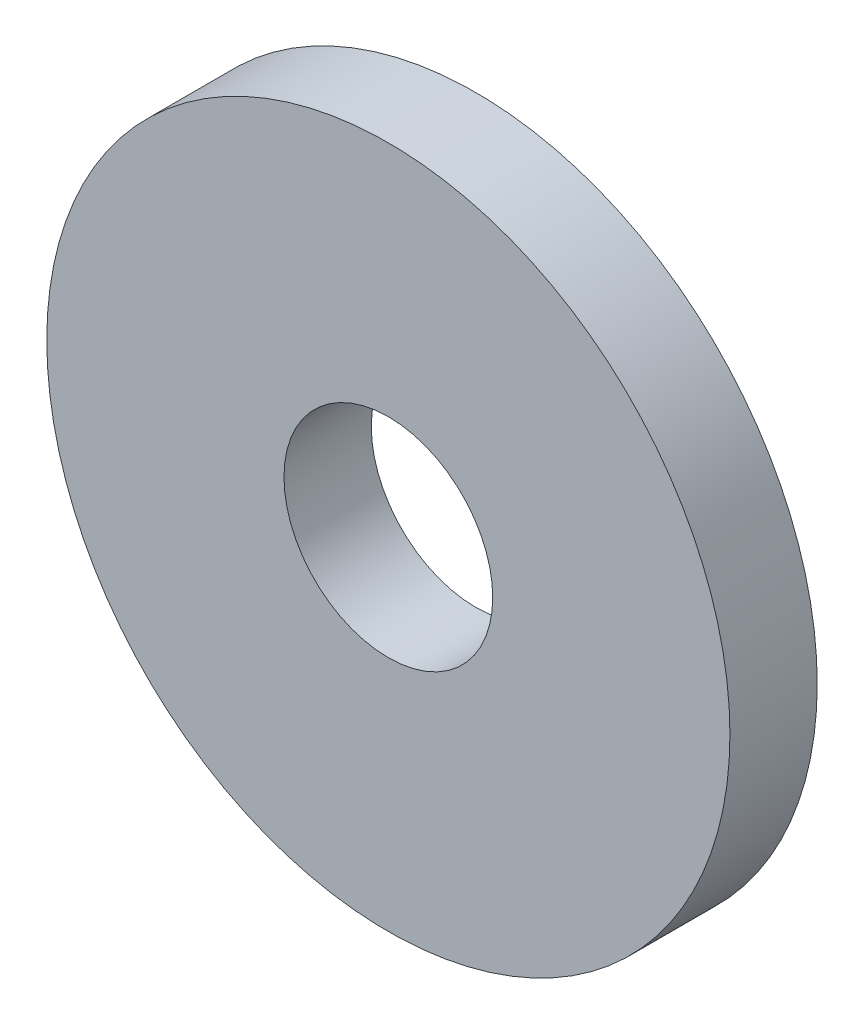
ISO-10303-21;
HEADER;
FILE_DESCRIPTION(('STEP AP214'),'2;1');
FILE_NAME('part.step','',(''),(''),'','','');
FILE_SCHEMA(('AUTOMOTIVE_DESIGN { 1 0 10303 214 1 1 1 1 }'));
ENDSEC;
DATA;
#1=APPLICATION_CONTEXT('core data for automotive mechanical design processes');
#2=APPLICATION_PROTOCOL_DEFINITION('international standard','automotive_design',2000,#1);
#3=PRODUCT_CONTEXT('',#1,'mechanical');
#4=PRODUCT('Part','Part','',(#3));
#5=PRODUCT_RELATED_PRODUCT_CATEGORY('part','',(#4));
#6=PRODUCT_DEFINITION_FORMATION('','',#4);
#7=PRODUCT_DEFINITION_CONTEXT('part definition',#1,'design');
#8=PRODUCT_DEFINITION('design','',#6,#7);
#9=PRODUCT_DEFINITION_SHAPE('','',#8);
#10=(LENGTH_UNIT() NAMED_UNIT(*) SI_UNIT(.MILLI.,.METRE.));
#11=(NAMED_UNIT(*) PLANE_ANGLE_UNIT() SI_UNIT($,.RADIAN.));
#12=(NAMED_UNIT(*) SI_UNIT($,.STERADIAN.) SOLID_ANGLE_UNIT());
#13=UNCERTAINTY_MEASURE_WITH_UNIT(LENGTH_MEASURE(1.E-05),#10,'distance_accuracy_value','');
#14=(GEOMETRIC_REPRESENTATION_CONTEXT(3) GLOBAL_UNCERTAINTY_ASSIGNED_CONTEXT((#13)) GLOBAL_UNIT_ASSIGNED_CONTEXT((#10,
#11,#12)) REPRESENTATION_CONTEXT('',''));
#15=CARTESIAN_POINT('',(0.,0.,0.));
#16=DIRECTION('',(0.,0.,1.));
#17=DIRECTION('',(1.,0.,0.));
#18=AXIS2_PLACEMENT_3D('',#15,#16,#17);
#19=CARTESIAN_POINT('',(0.,0.,2.3));
#20=DIRECTION('',(0.,0.,1.));
#21=DIRECTION('',(1.,0.,0.));
#22=AXIS2_PLACEMENT_3D('',#19,#20,#21);
#23=PLANE('',#22);
#24=CARTESIAN_POINT('',(0.,0.,2.3));
#25=DIRECTION('',(0.,0.,1.));
#26=DIRECTION('',(1.,0.,0.));
#27=AXIS2_PLACEMENT_3D('',#24,#25,#26);
#28=CIRCLE('',#27,9.);
#29=CARTESIAN_POINT('',(9.,0.,2.3));
#30=VERTEX_POINT('',#29);
#31=EDGE_CURVE('E10',#30,#30,#28,.T.);
#32=ORIENTED_EDGE('',*,*,#31,.T.);
#33=EDGE_LOOP('',(#32));
#34=FACE_BOUND('',#33,.T.);
#35=CARTESIAN_POINT('',(0.,0.,2.3));
#36=DIRECTION('',(0.,0.,1.));
#37=DIRECTION('',(1.,0.,0.));
#38=AXIS2_PLACEMENT_3D('',#35,#36,#37);
#39=CIRCLE('',#38,2.75);
#40=CARTESIAN_POINT('',(2.75,0.,2.3));
#41=VERTEX_POINT('',#40);
#42=EDGE_CURVE('E41',#41,#41,#39,.T.);
#43=ORIENTED_EDGE('',*,*,#42,.F.);
#44=EDGE_LOOP('',(#43));
#45=FACE_BOUND('',#44,.T.);
#46=ADVANCED_FACE('F30',(#34,#45),#23,.T.);
#47=CARTESIAN_POINT('',(0.,0.,0.));
#48=DIRECTION('',(0.,0.,1.));
#49=DIRECTION('',(1.,0.,0.));
#50=AXIS2_PLACEMENT_3D('',#47,#48,#49);
#51=PLANE('',#50);
#52=CARTESIAN_POINT('',(0.,0.,0.));
#53=DIRECTION('',(0.,0.,1.));
#54=DIRECTION('',(1.,0.,0.));
#55=AXIS2_PLACEMENT_3D('',#52,#53,#54);
#56=CIRCLE('',#55,9.);
#57=CARTESIAN_POINT('',(9.,0.,0.));
#58=VERTEX_POINT('',#57);
#59=EDGE_CURVE('E34',#58,#58,#56,.T.);
#60=ORIENTED_EDGE('',*,*,#59,.F.);
#61=EDGE_LOOP('',(#60));
#62=FACE_BOUND('',#61,.T.);
#63=CARTESIAN_POINT('',(0.,0.,0.));
#64=DIRECTION('',(0.,0.,1.));
#65=DIRECTION('',(1.,0.,0.));
#66=AXIS2_PLACEMENT_3D('',#63,#64,#65);
#67=CIRCLE('',#66,2.75);
#68=CARTESIAN_POINT('',(2.75,0.,0.));
#69=VERTEX_POINT('',#68);
#70=EDGE_CURVE('E43',#69,#69,#67,.T.);
#71=ORIENTED_EDGE('',*,*,#70,.T.);
#72=EDGE_LOOP('',(#71));
#73=FACE_BOUND('',#72,.T.);
#74=ADVANCED_FACE('F53',(#62,#73),#51,.F.);
#75=CARTESIAN_POINT('',(0.,0.,2.3));
#76=DIRECTION('',(0.,0.,-1.));
#77=DIRECTION('',(-1.,0.,0.));
#78=AXIS2_PLACEMENT_3D('',#75,#76,#77);
#79=CYLINDRICAL_SURFACE('',#78,9.);
#80=ORIENTED_EDGE('',*,*,#31,.F.);
#81=EDGE_LOOP('',(#80));
#82=FACE_BOUND('',#81,.T.);
#83=ORIENTED_EDGE('',*,*,#59,.T.);
#84=EDGE_LOOP('',(#83));
#85=FACE_BOUND('',#84,.T.);
#86=ADVANCED_FACE('F32',(#82,#85),#79,.T.);
#87=CARTESIAN_POINT('',(0.,0.,2.3));
#88=DIRECTION('',(0.,0.,-1.));
#89=DIRECTION('',(-1.,0.,0.));
#90=AXIS2_PLACEMENT_3D('',#87,#88,#89);
#91=CYLINDRICAL_SURFACE('',#90,2.75);
#92=ORIENTED_EDGE('',*,*,#42,.T.);
#93=EDGE_LOOP('',(#92));
#94=FACE_BOUND('',#93,.T.);
#95=ORIENTED_EDGE('',*,*,#70,.F.);
#96=EDGE_LOOP('',(#95));
#97=FACE_BOUND('',#96,.T.);
#98=ADVANCED_FACE('F49',(#94,#97),#91,.F.);
#99=CLOSED_SHELL('',(#46,#74,#86,#98));
#100=MANIFOLD_SOLID_BREP('B2',#99);
#101=ADVANCED_BREP_SHAPE_REPRESENTATION('',(#18,#100),#14);
#102=SHAPE_DEFINITION_REPRESENTATION(#9,#101);
ENDSEC;
END-ISO-10303-21;
